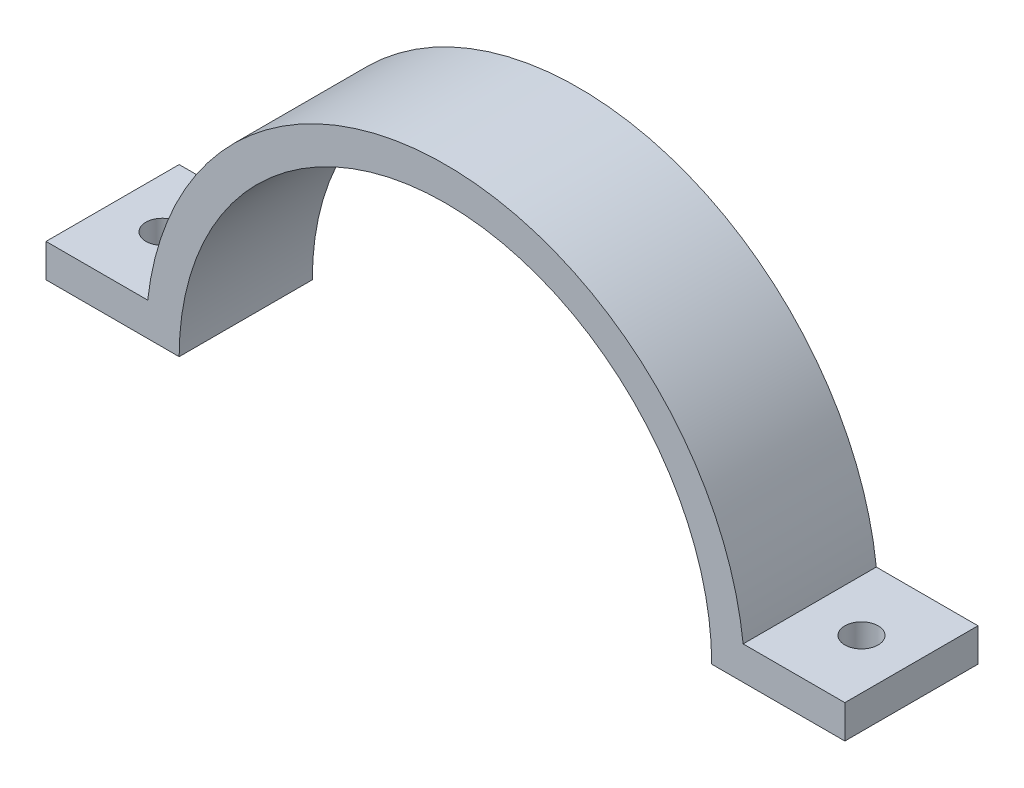
ISO-10303-21;
HEADER;
FILE_DESCRIPTION(('STEP AP214'),'2;1');
FILE_NAME('part.step','',(''),(''),'','','');
FILE_SCHEMA(('AUTOMOTIVE_DESIGN { 1 0 10303 214 1 1 1 1 }'));
ENDSEC;
DATA;
#1=APPLICATION_CONTEXT('core data for automotive mechanical design processes');
#2=APPLICATION_PROTOCOL_DEFINITION('international standard','automotive_design',2000,#1);
#3=PRODUCT_CONTEXT('',#1,'mechanical');
#4=PRODUCT('Part','Part','',(#3));
#5=PRODUCT_RELATED_PRODUCT_CATEGORY('part','',(#4));
#6=PRODUCT_DEFINITION_FORMATION('','',#4);
#7=PRODUCT_DEFINITION_CONTEXT('part definition',#1,'design');
#8=PRODUCT_DEFINITION('design','',#6,#7);
#9=PRODUCT_DEFINITION_SHAPE('','',#8);
#10=(LENGTH_UNIT() NAMED_UNIT(*) SI_UNIT(.MILLI.,.METRE.));
#11=(NAMED_UNIT(*) PLANE_ANGLE_UNIT() SI_UNIT($,.RADIAN.));
#12=(NAMED_UNIT(*) SI_UNIT($,.STERADIAN.) SOLID_ANGLE_UNIT());
#13=UNCERTAINTY_MEASURE_WITH_UNIT(LENGTH_MEASURE(1.E-05),#10,'distance_accuracy_value','');
#14=(GEOMETRIC_REPRESENTATION_CONTEXT(3) GLOBAL_UNCERTAINTY_ASSIGNED_CONTEXT((#13)) GLOBAL_UNIT_ASSIGNED_CONTEXT((#10,
#11,#12)) REPRESENTATION_CONTEXT('',''));
#15=CARTESIAN_POINT('',(0.,0.,0.));
#16=DIRECTION('',(0.,0.,1.));
#17=DIRECTION('',(1.,0.,0.));
#18=AXIS2_PLACEMENT_3D('',#15,#16,#17);
#19=CARTESIAN_POINT('',(-60.,5.,20.));
#20=DIRECTION('',(0.,-1.,0.));
#21=DIRECTION('',(0.,0.,-1.));
#22=AXIS2_PLACEMENT_3D('',#19,#20,#21);
#23=PLANE('',#22);
#24=CARTESIAN_POINT('',(-52.5,5.,10.));
#25=DIRECTION('',(0.,1.,0.));
#26=DIRECTION('',(0.,0.,1.));
#27=AXIS2_PLACEMENT_3D('',#24,#25,#26);
#28=CIRCLE('',#27,2.5);
#29=CARTESIAN_POINT('',(-52.5,5.,12.5));
#30=VERTEX_POINT('',#29);
#31=EDGE_CURVE('E191',#30,#30,#28,.T.);
#32=ORIENTED_EDGE('',*,*,#31,.F.);
#33=EDGE_LOOP('',(#32));
#34=FACE_BOUND('',#33,.T.);
#35=DIRECTION('',(-1.,0.,0.));
#36=VECTOR('',#35,1.);
#37=CARTESIAN_POINT('',(-60.,5.,0.));
#38=LINE('',#37,#36);
#39=CARTESIAN_POINT('',(-44.7213595499958,5.00000000000001,0.));
#40=VERTEX_POINT('',#39);
#41=CARTESIAN_POINT('',(-60.,5.,0.));
#42=VERTEX_POINT('',#41);
#43=EDGE_CURVE('E135',#40,#42,#38,.T.);
#44=ORIENTED_EDGE('',*,*,#43,.T.);
#45=DIRECTION('',(0.,0.,-1.));
#46=VECTOR('',#45,1.);
#47=CARTESIAN_POINT('',(-60.,5.,20.));
#48=LINE('',#47,#46);
#49=CARTESIAN_POINT('',(-60.,5.,20.));
#50=VERTEX_POINT('',#49);
#51=EDGE_CURVE('E11',#50,#42,#48,.T.);
#52=ORIENTED_EDGE('',*,*,#51,.F.);
#53=DIRECTION('',(-1.,0.,0.));
#54=VECTOR('',#53,1.);
#55=CARTESIAN_POINT('',(-60.,5.,20.));
#56=LINE('',#55,#54);
#57=CARTESIAN_POINT('',(-44.7213595499958,5.00000000000001,20.));
#58=VERTEX_POINT('',#57);
#59=EDGE_CURVE('E152',#58,#50,#56,.T.);
#60=ORIENTED_EDGE('',*,*,#59,.F.);
#61=DIRECTION('',(0.,0.,-1.));
#62=VECTOR('',#61,1.);
#63=CARTESIAN_POINT('',(-44.7213595499958,5.00000000000001,20.));
#64=LINE('',#63,#62);
#65=EDGE_CURVE('E131',#58,#40,#64,.T.);
#66=ORIENTED_EDGE('',*,*,#65,.T.);
#67=EDGE_LOOP('',(#44,#52,#60,#66));
#68=FACE_BOUND('',#67,.T.);
#69=ADVANCED_FACE('F39',(#34,#68),#23,.F.);
#70=CARTESIAN_POINT('',(-60.,0.,20.));
#71=DIRECTION('',(1.,0.,0.));
#72=DIRECTION('',(0.,0.,-1.));
#73=AXIS2_PLACEMENT_3D('',#70,#71,#72);
#74=PLANE('',#73);
#75=DIRECTION('',(0.,-1.,0.));
#76=VECTOR('',#75,1.);
#77=CARTESIAN_POINT('',(-60.,0.,0.));
#78=LINE('',#77,#76);
#79=CARTESIAN_POINT('',(-60.,0.,0.));
#80=VERTEX_POINT('',#79);
#81=EDGE_CURVE('E138',#42,#80,#78,.T.);
#82=ORIENTED_EDGE('',*,*,#81,.T.);
#83=DIRECTION('',(0.,0.,-1.));
#84=VECTOR('',#83,1.);
#85=CARTESIAN_POINT('',(-60.,0.,20.));
#86=LINE('',#85,#84);
#87=CARTESIAN_POINT('',(-60.,0.,20.));
#88=VERTEX_POINT('',#87);
#89=EDGE_CURVE('E47',#88,#80,#86,.T.);
#90=ORIENTED_EDGE('',*,*,#89,.F.);
#91=DIRECTION('',(0.,-1.,0.));
#92=VECTOR('',#91,1.);
#93=CARTESIAN_POINT('',(-60.,0.,20.));
#94=LINE('',#93,#92);
#95=EDGE_CURVE('E98',#50,#88,#94,.T.);
#96=ORIENTED_EDGE('',*,*,#95,.F.);
#97=ORIENTED_EDGE('',*,*,#51,.T.);
#98=EDGE_LOOP('',(#82,#90,#96,#97));
#99=FACE_BOUND('',#98,.T.);
#100=ADVANCED_FACE('F167',(#99),#74,.F.);
#101=CARTESIAN_POINT('',(-45.,0.,20.));
#102=DIRECTION('',(0.,1.,0.));
#103=DIRECTION('',(-1.,0.,0.));
#104=AXIS2_PLACEMENT_3D('',#101,#102,#103);
#105=PLANE('',#104);
#106=CARTESIAN_POINT('',(-52.5,0.,10.));
#107=DIRECTION('',(0.,1.,0.));
#108=DIRECTION('',(0.,0.,1.));
#109=AXIS2_PLACEMENT_3D('',#106,#107,#108);
#110=CIRCLE('',#109,2.5);
#111=CARTESIAN_POINT('',(-52.5,0.,12.5));
#112=VERTEX_POINT('',#111);
#113=EDGE_CURVE('E139',#112,#112,#110,.T.);
#114=ORIENTED_EDGE('',*,*,#113,.T.);
#115=EDGE_LOOP('',(#114));
#116=FACE_BOUND('',#115,.T.);
#117=DIRECTION('',(1.,0.,0.));
#118=VECTOR('',#117,1.);
#119=CARTESIAN_POINT('',(-45.,0.,0.));
#120=LINE('',#119,#118);
#121=CARTESIAN_POINT('',(-40.,0.,0.));
#122=VERTEX_POINT('',#121);
#123=EDGE_CURVE('E142',#80,#122,#120,.T.);
#124=ORIENTED_EDGE('',*,*,#123,.T.);
#125=DIRECTION('',(0.,0.,-1.));
#126=VECTOR('',#125,1.);
#127=CARTESIAN_POINT('',(-40.,0.,20.));
#128=LINE('',#127,#126);
#129=CARTESIAN_POINT('',(-40.,0.,20.));
#130=VERTEX_POINT('',#129);
#131=EDGE_CURVE('E159',#130,#122,#128,.T.);
#132=ORIENTED_EDGE('',*,*,#131,.F.);
#133=DIRECTION('',(1.,0.,0.));
#134=VECTOR('',#133,1.);
#135=CARTESIAN_POINT('',(-45.,0.,20.));
#136=LINE('',#135,#134);
#137=EDGE_CURVE('E166',#88,#130,#136,.T.);
#138=ORIENTED_EDGE('',*,*,#137,.F.);
#139=ORIENTED_EDGE('',*,*,#89,.T.);
#140=EDGE_LOOP('',(#124,#132,#138,#139));
#141=FACE_BOUND('',#140,.T.);
#142=ADVANCED_FACE('F164',(#116,#141),#105,.F.);
#143=CARTESIAN_POINT('',(0.,0.,20.));
#144=DIRECTION('',(0.,0.,-1.));
#145=DIRECTION('',(-1.,0.,0.));
#146=AXIS2_PLACEMENT_3D('',#143,#144,#145);
#147=CYLINDRICAL_SURFACE('',#146,40.);
#148=CARTESIAN_POINT('',(0.,0.,0.));
#149=DIRECTION('',(0.,0.,-1.));
#150=DIRECTION('',(1.,0.,0.));
#151=AXIS2_PLACEMENT_3D('',#148,#149,#150);
#152=CIRCLE('',#151,40.);
#153=CARTESIAN_POINT('',(40.,0.,0.));
#154=VERTEX_POINT('',#153);
#155=EDGE_CURVE('E144',#122,#154,#152,.T.);
#156=ORIENTED_EDGE('',*,*,#155,.T.);
#157=DIRECTION('',(0.,0.,-1.));
#158=VECTOR('',#157,1.);
#159=CARTESIAN_POINT('',(40.,0.,20.));
#160=LINE('',#159,#158);
#161=CARTESIAN_POINT('',(40.,0.,20.));
#162=VERTEX_POINT('',#161);
#163=EDGE_CURVE('E156',#162,#154,#160,.T.);
#164=ORIENTED_EDGE('',*,*,#163,.F.);
#165=CARTESIAN_POINT('',(0.,0.,20.));
#166=DIRECTION('',(0.,0.,-1.));
#167=DIRECTION('',(1.,0.,0.));
#168=AXIS2_PLACEMENT_3D('',#165,#166,#167);
#169=CIRCLE('',#168,40.);
#170=EDGE_CURVE('E179',#130,#162,#169,.T.);
#171=ORIENTED_EDGE('',*,*,#170,.F.);
#172=ORIENTED_EDGE('',*,*,#131,.T.);
#173=EDGE_LOOP('',(#156,#164,#171,#172));
#174=FACE_BOUND('',#173,.T.);
#175=ADVANCED_FACE('F175',(#174),#147,.F.);
#176=CARTESIAN_POINT('',(60.,0.,20.));
#177=DIRECTION('',(0.,1.,0.));
#178=DIRECTION('',(-1.,0.,0.));
#179=AXIS2_PLACEMENT_3D('',#176,#177,#178);
#180=PLANE('',#179);
#181=CARTESIAN_POINT('',(52.5,0.,10.));
#182=DIRECTION('',(0.,1.,0.));
#183=DIRECTION('',(0.,0.,1.));
#184=AXIS2_PLACEMENT_3D('',#181,#182,#183);
#185=CIRCLE('',#184,2.5);
#186=CARTESIAN_POINT('',(52.5,0.,12.5));
#187=VERTEX_POINT('',#186);
#188=EDGE_CURVE('E188',#187,#187,#185,.T.);
#189=ORIENTED_EDGE('',*,*,#188,.T.);
#190=EDGE_LOOP('',(#189));
#191=FACE_BOUND('',#190,.T.);
#192=DIRECTION('',(1.,0.,0.));
#193=VECTOR('',#192,1.);
#194=CARTESIAN_POINT('',(60.,0.,0.));
#195=LINE('',#194,#193);
#196=CARTESIAN_POINT('',(60.,0.,0.));
#197=VERTEX_POINT('',#196);
#198=EDGE_CURVE('E147',#154,#197,#195,.T.);
#199=ORIENTED_EDGE('',*,*,#198,.T.);
#200=DIRECTION('',(0.,0.,-1.));
#201=VECTOR('',#200,1.);
#202=CARTESIAN_POINT('',(60.,0.,20.));
#203=LINE('',#202,#201);
#204=CARTESIAN_POINT('',(60.,0.,20.));
#205=VERTEX_POINT('',#204);
#206=EDGE_CURVE('E126',#205,#197,#203,.T.);
#207=ORIENTED_EDGE('',*,*,#206,.F.);
#208=DIRECTION('',(1.,0.,0.));
#209=VECTOR('',#208,1.);
#210=CARTESIAN_POINT('',(40.,0.,20.));
#211=LINE('',#210,#209);
#212=EDGE_CURVE('E117',#162,#205,#211,.T.);
#213=ORIENTED_EDGE('',*,*,#212,.F.);
#214=ORIENTED_EDGE('',*,*,#163,.T.);
#215=EDGE_LOOP('',(#199,#207,#213,#214));
#216=FACE_BOUND('',#215,.T.);
#217=ADVANCED_FACE('F178',(#191,#216),#180,.F.);
#218=CARTESIAN_POINT('',(60.,5.,20.));
#219=DIRECTION('',(-1.,0.,0.));
#220=DIRECTION('',(0.,0.,1.));
#221=AXIS2_PLACEMENT_3D('',#218,#219,#220);
#222=PLANE('',#221);
#223=DIRECTION('',(0.,1.,0.));
#224=VECTOR('',#223,1.);
#225=CARTESIAN_POINT('',(60.,5.,0.));
#226=LINE('',#225,#224);
#227=CARTESIAN_POINT('',(60.,5.,0.));
#228=VERTEX_POINT('',#227);
#229=EDGE_CURVE('E125',#197,#228,#226,.T.);
#230=ORIENTED_EDGE('',*,*,#229,.T.);
#231=DIRECTION('',(0.,0.,-1.));
#232=VECTOR('',#231,1.);
#233=CARTESIAN_POINT('',(60.,5.,20.));
#234=LINE('',#233,#232);
#235=CARTESIAN_POINT('',(60.,5.,20.));
#236=VERTEX_POINT('',#235);
#237=EDGE_CURVE('E122',#236,#228,#234,.T.);
#238=ORIENTED_EDGE('',*,*,#237,.F.);
#239=DIRECTION('',(0.,1.,0.));
#240=VECTOR('',#239,1.);
#241=CARTESIAN_POINT('',(60.,5.,20.));
#242=LINE('',#241,#240);
#243=EDGE_CURVE('E111',#205,#236,#242,.T.);
#244=ORIENTED_EDGE('',*,*,#243,.F.);
#245=ORIENTED_EDGE('',*,*,#206,.T.);
#246=EDGE_LOOP('',(#230,#238,#244,#245));
#247=FACE_BOUND('',#246,.T.);
#248=ADVANCED_FACE('F123',(#247),#222,.F.);
#249=CARTESIAN_POINT('',(44.7213595499958,5.,20.));
#250=DIRECTION('',(0.,-1.,0.));
#251=DIRECTION('',(0.,0.,-1.));
#252=AXIS2_PLACEMENT_3D('',#249,#250,#251);
#253=PLANE('',#252);
#254=CARTESIAN_POINT('',(52.5,5.,10.));
#255=DIRECTION('',(0.,1.,0.));
#256=DIRECTION('',(0.,0.,1.));
#257=AXIS2_PLACEMENT_3D('',#254,#255,#256);
#258=CIRCLE('',#257,2.5);
#259=CARTESIAN_POINT('',(52.5,5.,12.5));
#260=VERTEX_POINT('',#259);
#261=EDGE_CURVE('E185',#260,#260,#258,.T.);
#262=ORIENTED_EDGE('',*,*,#261,.F.);
#263=EDGE_LOOP('',(#262));
#264=FACE_BOUND('',#263,.T.);
#265=DIRECTION('',(-1.,0.,0.));
#266=VECTOR('',#265,1.);
#267=CARTESIAN_POINT('',(44.7213595499958,5.,0.));
#268=LINE('',#267,#266);
#269=CARTESIAN_POINT('',(44.7213595499958,5.,0.));
#270=VERTEX_POINT('',#269);
#271=EDGE_CURVE('E84',#228,#270,#268,.T.);
#272=ORIENTED_EDGE('',*,*,#271,.T.);
#273=DIRECTION('',(0.,0.,-1.));
#274=VECTOR('',#273,1.);
#275=CARTESIAN_POINT('',(44.7213595499958,5.,20.));
#276=LINE('',#275,#274);
#277=CARTESIAN_POINT('',(44.7213595499958,5.,20.));
#278=VERTEX_POINT('',#277);
#279=EDGE_CURVE('E127',#278,#270,#276,.T.);
#280=ORIENTED_EDGE('',*,*,#279,.F.);
#281=DIRECTION('',(-1.,0.,0.));
#282=VECTOR('',#281,1.);
#283=CARTESIAN_POINT('',(44.7213595499958,5.,20.));
#284=LINE('',#283,#282);
#285=EDGE_CURVE('E115',#236,#278,#284,.T.);
#286=ORIENTED_EDGE('',*,*,#285,.F.);
#287=ORIENTED_EDGE('',*,*,#237,.T.);
#288=EDGE_LOOP('',(#272,#280,#286,#287));
#289=FACE_BOUND('',#288,.T.);
#290=ADVANCED_FACE('F129',(#264,#289),#253,.F.);
#291=CARTESIAN_POINT('',(0.,0.,20.));
#292=DIRECTION('',(0.,0.,-1.));
#293=DIRECTION('',(-1.,0.,0.));
#294=AXIS2_PLACEMENT_3D('',#291,#292,#293);
#295=CYLINDRICAL_SURFACE('',#294,45.);
#296=CARTESIAN_POINT('',(0.,0.,0.));
#297=DIRECTION('',(0.,0.,1.));
#298=DIRECTION('',(1.,0.,0.));
#299=AXIS2_PLACEMENT_3D('',#296,#297,#298);
#300=CIRCLE('',#299,45.);
#301=EDGE_CURVE('E90',#270,#40,#300,.T.);
#302=ORIENTED_EDGE('',*,*,#301,.T.);
#303=ORIENTED_EDGE('',*,*,#65,.F.);
#304=CARTESIAN_POINT('',(0.,0.,20.));
#305=DIRECTION('',(0.,0.,1.));
#306=DIRECTION('',(1.,0.,0.));
#307=AXIS2_PLACEMENT_3D('',#304,#305,#306);
#308=CIRCLE('',#307,45.);
#309=EDGE_CURVE('E55',#278,#58,#308,.T.);
#310=ORIENTED_EDGE('',*,*,#309,.F.);
#311=ORIENTED_EDGE('',*,*,#279,.T.);
#312=EDGE_LOOP('',(#302,#303,#310,#311));
#313=FACE_BOUND('',#312,.T.);
#314=ADVANCED_FACE('F208',(#313),#295,.T.);
#315=CARTESIAN_POINT('',(0.,0.,20.));
#316=DIRECTION('',(0.,0.,1.));
#317=DIRECTION('',(1.,0.,0.));
#318=AXIS2_PLACEMENT_3D('',#315,#316,#317);
#319=PLANE('',#318);
#320=ORIENTED_EDGE('',*,*,#59,.T.);
#321=ORIENTED_EDGE('',*,*,#95,.T.);
#322=ORIENTED_EDGE('',*,*,#137,.T.);
#323=ORIENTED_EDGE('',*,*,#170,.T.);
#324=ORIENTED_EDGE('',*,*,#212,.T.);
#325=ORIENTED_EDGE('',*,*,#243,.T.);
#326=ORIENTED_EDGE('',*,*,#285,.T.);
#327=ORIENTED_EDGE('',*,*,#309,.T.);
#328=EDGE_LOOP('',(#320,#321,#322,#323,#324,#325,#326,#327));
#329=FACE_BOUND('',#328,.T.);
#330=ADVANCED_FACE('F113',(#329),#319,.T.);
#331=CARTESIAN_POINT('',(0.,0.,0.));
#332=DIRECTION('',(0.,0.,1.));
#333=DIRECTION('',(1.,0.,0.));
#334=AXIS2_PLACEMENT_3D('',#331,#332,#333);
#335=PLANE('',#334);
#336=ORIENTED_EDGE('',*,*,#43,.F.);
#337=ORIENTED_EDGE('',*,*,#301,.F.);
#338=ORIENTED_EDGE('',*,*,#271,.F.);
#339=ORIENTED_EDGE('',*,*,#229,.F.);
#340=ORIENTED_EDGE('',*,*,#198,.F.);
#341=ORIENTED_EDGE('',*,*,#155,.F.);
#342=ORIENTED_EDGE('',*,*,#123,.F.);
#343=ORIENTED_EDGE('',*,*,#81,.F.);
#344=EDGE_LOOP('',(#336,#337,#338,#339,#340,#341,#342,#343));
#345=FACE_BOUND('',#344,.T.);
#346=ADVANCED_FACE('F171',(#345),#335,.F.);
#347=CARTESIAN_POINT('',(52.5,0.,10.));
#348=DIRECTION('',(0.,1.,0.));
#349=DIRECTION('',(0.,0.,1.));
#350=AXIS2_PLACEMENT_3D('',#347,#348,#349);
#351=CYLINDRICAL_SURFACE('',#350,2.5);
#352=ORIENTED_EDGE('',*,*,#188,.F.);
#353=EDGE_LOOP('',(#352));
#354=FACE_BOUND('',#353,.T.);
#355=ORIENTED_EDGE('',*,*,#261,.T.);
#356=EDGE_LOOP('',(#355));
#357=FACE_BOUND('',#356,.T.);
#358=ADVANCED_FACE('F201',(#354,#357),#351,.F.);
#359=CARTESIAN_POINT('',(-52.5,0.,10.));
#360=DIRECTION('',(0.,1.,0.));
#361=DIRECTION('',(0.,0.,1.));
#362=AXIS2_PLACEMENT_3D('',#359,#360,#361);
#363=CYLINDRICAL_SURFACE('',#362,2.5);
#364=ORIENTED_EDGE('',*,*,#113,.F.);
#365=EDGE_LOOP('',(#364));
#366=FACE_BOUND('',#365,.T.);
#367=ORIENTED_EDGE('',*,*,#31,.T.);
#368=EDGE_LOOP('',(#367));
#369=FACE_BOUND('',#368,.T.);
#370=ADVANCED_FACE('F198',(#366,#369),#363,.F.);
#371=CLOSED_SHELL('',(#69,#100,#142,#175,#217,#248,#290,#314,#330,#346,#358,#370));
#372=MANIFOLD_SOLID_BREP('B2',#371);
#373=ADVANCED_BREP_SHAPE_REPRESENTATION('',(#18,#372),#14);
#374=SHAPE_DEFINITION_REPRESENTATION(#9,#373);
ENDSEC;
END-ISO-10303-21;
